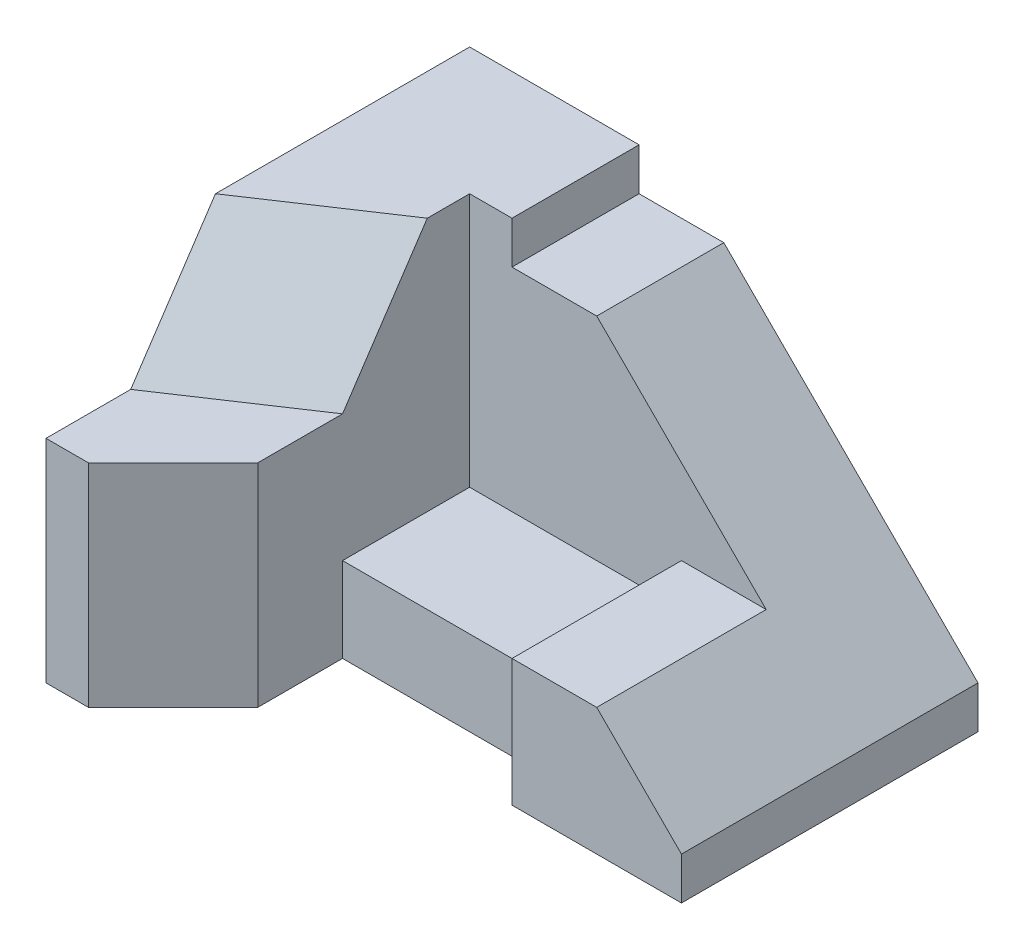
ISO-10303-21;
HEADER;
FILE_DESCRIPTION(('STEP AP214'),'2;1');
FILE_NAME('part.step','',(''),(''),'','','');
FILE_SCHEMA(('AUTOMOTIVE_DESIGN { 1 0 10303 214 1 1 1 1 }'));
ENDSEC;
DATA;
#1=APPLICATION_CONTEXT('core data for automotive mechanical design processes');
#2=APPLICATION_PROTOCOL_DEFINITION('international standard','automotive_design',2000,#1);
#3=PRODUCT_CONTEXT('',#1,'mechanical');
#4=PRODUCT('Part','Part','',(#3));
#5=PRODUCT_RELATED_PRODUCT_CATEGORY('part','',(#4));
#6=PRODUCT_DEFINITION_FORMATION('','',#4);
#7=PRODUCT_DEFINITION_CONTEXT('part definition',#1,'design');
#8=PRODUCT_DEFINITION('design','',#6,#7);
#9=PRODUCT_DEFINITION_SHAPE('','',#8);
#10=(LENGTH_UNIT() NAMED_UNIT(*) SI_UNIT(.MILLI.,.METRE.));
#11=(NAMED_UNIT(*) PLANE_ANGLE_UNIT() SI_UNIT($,.RADIAN.));
#12=(NAMED_UNIT(*) SI_UNIT($,.STERADIAN.) SOLID_ANGLE_UNIT());
#13=UNCERTAINTY_MEASURE_WITH_UNIT(LENGTH_MEASURE(1.E-05),#10,'distance_accuracy_value','');
#14=(GEOMETRIC_REPRESENTATION_CONTEXT(3) GLOBAL_UNCERTAINTY_ASSIGNED_CONTEXT((#13)) GLOBAL_UNIT_ASSIGNED_CONTEXT((#10,
#11,#12)) REPRESENTATION_CONTEXT('',''));
#15=CARTESIAN_POINT('',(0.,0.,0.));
#16=DIRECTION('',(0.,0.,1.));
#17=DIRECTION('',(1.,0.,0.));
#18=AXIS2_PLACEMENT_3D('',#15,#16,#17);
#19=CARTESIAN_POINT('',(40.,80.,-30.));
#20=DIRECTION('',(0.,0.,-1.));
#21=DIRECTION('',(-1.,0.,0.));
#22=AXIS2_PLACEMENT_3D('',#19,#20,#21);
#23=PLANE('',#22);
#24=DIRECTION('',(1.,0.,0.));
#25=VECTOR('',#24,1.);
#26=CARTESIAN_POINT('',(0.,20.,-30.));
#27=LINE('',#26,#25);
#28=CARTESIAN_POINT('',(30.,20.,-30.));
#29=VERTEX_POINT('',#28);
#30=CARTESIAN_POINT('',(80.,20.,-30.));
#31=VERTEX_POINT('',#30);
#32=EDGE_CURVE('E142',#29,#31,#27,.T.);
#33=ORIENTED_EDGE('',*,*,#32,.T.);
#34=DIRECTION('',(0.,1.,0.));
#35=VECTOR('',#34,1.);
#36=CARTESIAN_POINT('',(80.,30.,-30.));
#37=LINE('',#36,#35);
#38=CARTESIAN_POINT('',(80.,30.,-30.));
#39=VERTEX_POINT('',#38);
#40=EDGE_CURVE('E293',#31,#39,#37,.T.);
#41=ORIENTED_EDGE('',*,*,#40,.T.);
#42=DIRECTION('',(1.,0.,0.));
#43=VECTOR('',#42,1.);
#44=CARTESIAN_POINT('',(100.,30.,-30.));
#45=LINE('',#44,#43);
#46=CARTESIAN_POINT('',(100.,30.,-30.));
#47=VERTEX_POINT('',#46);
#48=EDGE_CURVE('E299',#39,#47,#45,.T.);
#49=ORIENTED_EDGE('',*,*,#48,.T.);
#50=DIRECTION('',(-0.707106781186548,0.707106781186548,0.));
#51=VECTOR('',#50,1.);
#52=CARTESIAN_POINT('',(60.,70.,-30.));
#53=LINE('',#52,#51);
#54=CARTESIAN_POINT('',(60.,70.,-30.));
#55=VERTEX_POINT('',#54);
#56=EDGE_CURVE('E297',#47,#55,#53,.T.);
#57=ORIENTED_EDGE('',*,*,#56,.T.);
#58=DIRECTION('',(1.,0.,0.));
#59=VECTOR('',#58,1.);
#60=CARTESIAN_POINT('',(40.,70.,-30.));
#61=LINE('',#60,#59);
#62=CARTESIAN_POINT('',(40.,70.,-30.));
#63=VERTEX_POINT('',#62);
#64=EDGE_CURVE('E116',#63,#55,#61,.T.);
#65=ORIENTED_EDGE('',*,*,#64,.F.);
#66=DIRECTION('',(0.,-1.,0.));
#67=VECTOR('',#66,1.);
#68=CARTESIAN_POINT('',(40.,80.,-30.));
#69=LINE('',#68,#67);
#70=CARTESIAN_POINT('',(40.,80.,-30.));
#71=VERTEX_POINT('',#70);
#72=EDGE_CURVE('E44',#71,#63,#69,.T.);
#73=ORIENTED_EDGE('',*,*,#72,.F.);
#74=DIRECTION('',(1.,0.,0.));
#75=VECTOR('',#74,1.);
#76=CARTESIAN_POINT('',(40.,80.,-30.));
#77=LINE('',#76,#75);
#78=CARTESIAN_POINT('',(30.,80.,-30.));
#79=VERTEX_POINT('',#78);
#80=EDGE_CURVE('E100',#79,#71,#77,.T.);
#81=ORIENTED_EDGE('',*,*,#80,.F.);
#82=DIRECTION('',(0.,-1.,0.));
#83=VECTOR('',#82,1.);
#84=CARTESIAN_POINT('',(30.,80.,-30.));
#85=LINE('',#84,#83);
#86=EDGE_CURVE('E11',#79,#29,#85,.T.);
#87=ORIENTED_EDGE('',*,*,#86,.T.);
#88=EDGE_LOOP('',(#33,#41,#49,#57,#65,#73,#81,#87));
#89=FACE_BOUND('',#88,.T.);
#90=ADVANCED_FACE('F35',(#89),#23,.F.);
#91=CARTESIAN_POINT('',(0.,80.,-60.));
#92=DIRECTION('',(0.,0.,1.));
#93=DIRECTION('',(1.,0.,0.));
#94=AXIS2_PLACEMENT_3D('',#91,#92,#93);
#95=PLANE('',#94);
#96=DIRECTION('',(0.,1.,0.));
#97=VECTOR('',#96,1.);
#98=CARTESIAN_POINT('',(120.,10.,-60.));
#99=LINE('',#98,#97);
#100=CARTESIAN_POINT('',(120.,0.,-60.));
#101=VERTEX_POINT('',#100);
#102=CARTESIAN_POINT('',(120.,10.,-60.));
#103=VERTEX_POINT('',#102);
#104=EDGE_CURVE('E263',#101,#103,#99,.T.);
#105=ORIENTED_EDGE('',*,*,#104,.F.);
#106=DIRECTION('',(-1.,0.,0.));
#107=VECTOR('',#106,1.);
#108=CARTESIAN_POINT('',(0.,0.,-60.));
#109=LINE('',#108,#107);
#110=CARTESIAN_POINT('',(0.,0.,-60.));
#111=VERTEX_POINT('',#110);
#112=EDGE_CURVE('E73',#101,#111,#109,.T.);
#113=ORIENTED_EDGE('',*,*,#112,.T.);
#114=DIRECTION('',(0.,-1.,0.));
#115=VECTOR('',#114,1.);
#116=CARTESIAN_POINT('',(0.,80.,-60.));
#117=LINE('',#116,#115);
#118=CARTESIAN_POINT('',(0.,80.,-60.));
#119=VERTEX_POINT('',#118);
#120=EDGE_CURVE('E126',#119,#111,#117,.T.);
#121=ORIENTED_EDGE('',*,*,#120,.F.);
#122=DIRECTION('',(-1.,0.,0.));
#123=VECTOR('',#122,1.);
#124=CARTESIAN_POINT('',(0.,80.,-60.));
#125=LINE('',#124,#123);
#126=CARTESIAN_POINT('',(40.,80.,-60.));
#127=VERTEX_POINT('',#126);
#128=EDGE_CURVE('E61',#127,#119,#125,.T.);
#129=ORIENTED_EDGE('',*,*,#128,.F.);
#130=DIRECTION('',(0.,-1.,0.));
#131=VECTOR('',#130,1.);
#132=CARTESIAN_POINT('',(40.,80.,-60.));
#133=LINE('',#132,#131);
#134=CARTESIAN_POINT('',(40.,70.,-60.));
#135=VERTEX_POINT('',#134);
#136=EDGE_CURVE('E117',#127,#135,#133,.T.);
#137=ORIENTED_EDGE('',*,*,#136,.T.);
#138=DIRECTION('',(-1.,0.,0.));
#139=VECTOR('',#138,1.);
#140=CARTESIAN_POINT('',(40.,70.,-60.));
#141=LINE('',#140,#139);
#142=CARTESIAN_POINT('',(60.,70.,-60.));
#143=VERTEX_POINT('',#142);
#144=EDGE_CURVE('E143',#143,#135,#141,.T.);
#145=ORIENTED_EDGE('',*,*,#144,.F.);
#146=DIRECTION('',(-0.707106781186548,0.707106781186548,0.));
#147=VECTOR('',#146,1.);
#148=CARTESIAN_POINT('',(60.,70.,-60.));
#149=LINE('',#148,#147);
#150=EDGE_CURVE('E294',#103,#143,#149,.T.);
#151=ORIENTED_EDGE('',*,*,#150,.F.);
#152=EDGE_LOOP('',(#105,#113,#121,#129,#137,#145,#151));
#153=FACE_BOUND('',#152,.T.);
#154=ADVANCED_FACE('F319',(#153),#95,.F.);
#155=CARTESIAN_POINT('',(40.,80.,-60.));
#156=DIRECTION('',(-1.,0.,0.));
#157=DIRECTION('',(0.,0.,1.));
#158=AXIS2_PLACEMENT_3D('',#155,#156,#157);
#159=PLANE('',#158);
#160=DIRECTION('',(0.,0.,1.));
#161=VECTOR('',#160,1.);
#162=CARTESIAN_POINT('',(40.,70.,-60.));
#163=LINE('',#162,#161);
#164=EDGE_CURVE('E52',#135,#63,#163,.T.);
#165=ORIENTED_EDGE('',*,*,#164,.F.);
#166=ORIENTED_EDGE('',*,*,#136,.F.);
#167=DIRECTION('',(0.,0.,-1.));
#168=VECTOR('',#167,1.);
#169=CARTESIAN_POINT('',(40.,80.,-60.));
#170=LINE('',#169,#168);
#171=EDGE_CURVE('E105',#71,#127,#170,.T.);
#172=ORIENTED_EDGE('',*,*,#171,.F.);
#173=ORIENTED_EDGE('',*,*,#72,.T.);
#174=EDGE_LOOP('',(#165,#166,#172,#173));
#175=FACE_BOUND('',#174,.T.);
#176=ADVANCED_FACE('F119',(#175),#159,.F.);
#177=CARTESIAN_POINT('',(0.,80.,0.));
#178=DIRECTION('',(0.,-1.,0.));
#179=DIRECTION('',(0.,0.,-1.));
#180=AXIS2_PLACEMENT_3D('',#177,#178,#179);
#181=PLANE('',#180);
#182=DIRECTION('',(0.832050294337844,0.,-0.554700196225229));
#183=VECTOR('',#182,1.);
#184=CARTESIAN_POINT('',(30.,80.,-20.));
#185=LINE('',#184,#183);
#186=CARTESIAN_POINT('',(0.,80.,0.));
#187=VERTEX_POINT('',#186);
#188=CARTESIAN_POINT('',(30.,80.,-20.));
#189=VERTEX_POINT('',#188);
#190=EDGE_CURVE('E130',#187,#189,#185,.T.);
#191=ORIENTED_EDGE('',*,*,#190,.T.);
#192=DIRECTION('',(0.,0.,-1.));
#193=VECTOR('',#192,1.);
#194=CARTESIAN_POINT('',(30.,80.,-30.));
#195=LINE('',#194,#193);
#196=EDGE_CURVE('E107',#189,#79,#195,.T.);
#197=ORIENTED_EDGE('',*,*,#196,.T.);
#198=ORIENTED_EDGE('',*,*,#80,.T.);
#199=ORIENTED_EDGE('',*,*,#171,.T.);
#200=ORIENTED_EDGE('',*,*,#128,.T.);
#201=DIRECTION('',(0.,0.,1.));
#202=VECTOR('',#201,1.);
#203=CARTESIAN_POINT('',(0.,80.,0.));
#204=LINE('',#203,#202);
#205=EDGE_CURVE('E121',#119,#187,#204,.T.);
#206=ORIENTED_EDGE('',*,*,#205,.T.);
#207=EDGE_LOOP('',(#191,#197,#198,#199,#200,#206));
#208=FACE_BOUND('',#207,.T.);
#209=ADVANCED_FACE('F103',(#208),#181,.F.);
#210=CARTESIAN_POINT('',(30.,80.,-30.));
#211=DIRECTION('',(-1.,0.,0.));
#212=DIRECTION('',(0.,0.,1.));
#213=AXIS2_PLACEMENT_3D('',#210,#211,#212);
#214=PLANE('',#213);
#215=ORIENTED_EDGE('',*,*,#196,.F.);
#216=DIRECTION('',(0.,0.832050294337843,-0.554700196225229));
#217=VECTOR('',#216,1.);
#218=CARTESIAN_POINT('',(30.,50.,0.));
#219=LINE('',#218,#217);
#220=CARTESIAN_POINT('',(30.,50.,0.));
#221=VERTEX_POINT('',#220);
#222=EDGE_CURVE('E150',#221,#189,#219,.T.);
#223=ORIENTED_EDGE('',*,*,#222,.F.);
#224=DIRECTION('',(0.,0.,-1.));
#225=VECTOR('',#224,1.);
#226=CARTESIAN_POINT('',(30.,50.,0.));
#227=LINE('',#226,#225);
#228=CARTESIAN_POINT('',(30.,50.,20.));
#229=VERTEX_POINT('',#228);
#230=EDGE_CURVE('E233',#229,#221,#227,.T.);
#231=ORIENTED_EDGE('',*,*,#230,.F.);
#232=DIRECTION('',(0.,-1.,0.));
#233=VECTOR('',#232,1.);
#234=CARTESIAN_POINT('',(30.,50.,20.));
#235=LINE('',#234,#233);
#236=CARTESIAN_POINT('',(30.,0.,20.));
#237=VERTEX_POINT('',#236);
#238=EDGE_CURVE('E241',#229,#237,#235,.T.);
#239=ORIENTED_EDGE('',*,*,#238,.T.);
#240=DIRECTION('',(0.,0.,-1.));
#241=VECTOR('',#240,1.);
#242=CARTESIAN_POINT('',(30.,0.,0.));
#243=LINE('',#242,#241);
#244=CARTESIAN_POINT('',(30.,0.,0.));
#245=VERTEX_POINT('',#244);
#246=EDGE_CURVE('E244',#237,#245,#243,.T.);
#247=ORIENTED_EDGE('',*,*,#246,.T.);
#248=DIRECTION('',(0.,1.,0.));
#249=VECTOR('',#248,1.);
#250=CARTESIAN_POINT('',(30.,20.,0.));
#251=LINE('',#250,#249);
#252=CARTESIAN_POINT('',(30.,20.,0.));
#253=VERTEX_POINT('',#252);
#254=EDGE_CURVE('E256',#245,#253,#251,.T.);
#255=ORIENTED_EDGE('',*,*,#254,.T.);
#256=DIRECTION('',(0.,0.,-1.));
#257=VECTOR('',#256,1.);
#258=CARTESIAN_POINT('',(30.,20.,0.));
#259=LINE('',#258,#257);
#260=EDGE_CURVE('E181',#253,#29,#259,.T.);
#261=ORIENTED_EDGE('',*,*,#260,.T.);
#262=ORIENTED_EDGE('',*,*,#86,.F.);
#263=EDGE_LOOP('',(#215,#223,#231,#239,#247,#255,#261,#262));
#264=FACE_BOUND('',#263,.T.);
#265=ADVANCED_FACE('F37',(#264),#214,.F.);
#266=CARTESIAN_POINT('',(0.,80.,0.));
#267=DIRECTION('',(1.,0.,0.));
#268=DIRECTION('',(0.,0.,-1.));
#269=AXIS2_PLACEMENT_3D('',#266,#267,#268);
#270=PLANE('',#269);
#271=DIRECTION('',(0.,0.,1.));
#272=VECTOR('',#271,1.);
#273=CARTESIAN_POINT('',(0.,50.,0.));
#274=LINE('',#273,#272);
#275=CARTESIAN_POINT('',(0.,50.,20.));
#276=VERTEX_POINT('',#275);
#277=CARTESIAN_POINT('',(0.,50.,40.));
#278=VERTEX_POINT('',#277);
#279=EDGE_CURVE('E163',#276,#278,#274,.T.);
#280=ORIENTED_EDGE('',*,*,#279,.F.);
#281=DIRECTION('',(0.,-0.832050294337844,0.554700196225229));
#282=VECTOR('',#281,1.);
#283=CARTESIAN_POINT('',(0.,24.6153846153846,36.9230769230769));
#284=LINE('',#283,#282);
#285=EDGE_CURVE('E160',#187,#276,#284,.T.);
#286=ORIENTED_EDGE('',*,*,#285,.F.);
#287=ORIENTED_EDGE('',*,*,#205,.F.);
#288=ORIENTED_EDGE('',*,*,#120,.T.);
#289=DIRECTION('',(0.,0.,1.));
#290=VECTOR('',#289,1.);
#291=CARTESIAN_POINT('',(0.,0.,0.));
#292=LINE('',#291,#290);
#293=CARTESIAN_POINT('',(0.,0.,40.));
#294=VERTEX_POINT('',#293);
#295=EDGE_CURVE('E128',#111,#294,#292,.T.);
#296=ORIENTED_EDGE('',*,*,#295,.T.);
#297=DIRECTION('',(0.,-1.,0.));
#298=VECTOR('',#297,1.);
#299=CARTESIAN_POINT('',(0.,0.,40.));
#300=LINE('',#299,#298);
#301=EDGE_CURVE('E155',#278,#294,#300,.T.);
#302=ORIENTED_EDGE('',*,*,#301,.F.);
#303=EDGE_LOOP('',(#280,#286,#287,#288,#296,#302));
#304=FACE_BOUND('',#303,.T.);
#305=ADVANCED_FACE('F229',(#304),#270,.F.);
#306=CARTESIAN_POINT('',(0.,0.,0.));
#307=DIRECTION('',(0.,-1.,0.));
#308=DIRECTION('',(0.,0.,-1.));
#309=AXIS2_PLACEMENT_3D('',#306,#307,#308);
#310=PLANE('',#309);
#311=DIRECTION('',(-0.707106781186548,0.,0.707106781186548));
#312=VECTOR('',#311,1.);
#313=CARTESIAN_POINT('',(25.,0.,25.));
#314=LINE('',#313,#312);
#315=CARTESIAN_POINT('',(10.,0.,40.));
#316=VERTEX_POINT('',#315);
#317=EDGE_CURVE('E239',#237,#316,#314,.T.);
#318=ORIENTED_EDGE('',*,*,#317,.T.);
#319=DIRECTION('',(-1.,0.,0.));
#320=VECTOR('',#319,1.);
#321=CARTESIAN_POINT('',(10.,0.,40.));
#322=LINE('',#321,#320);
#323=EDGE_CURVE('E159',#316,#294,#322,.T.);
#324=ORIENTED_EDGE('',*,*,#323,.T.);
#325=ORIENTED_EDGE('',*,*,#295,.F.);
#326=ORIENTED_EDGE('',*,*,#112,.F.);
#327=DIRECTION('',(0.,0.,-1.));
#328=VECTOR('',#327,1.);
#329=CARTESIAN_POINT('',(120.,0.,10.));
#330=LINE('',#329,#328);
#331=CARTESIAN_POINT('',(120.,0.,10.));
#332=VERTEX_POINT('',#331);
#333=EDGE_CURVE('E284',#332,#101,#330,.T.);
#334=ORIENTED_EDGE('',*,*,#333,.F.);
#335=DIRECTION('',(1.,0.,0.));
#336=VECTOR('',#335,1.);
#337=CARTESIAN_POINT('',(120.,0.,10.));
#338=LINE('',#337,#336);
#339=CARTESIAN_POINT('',(80.,0.,10.));
#340=VERTEX_POINT('',#339);
#341=EDGE_CURVE('E272',#340,#332,#338,.T.);
#342=ORIENTED_EDGE('',*,*,#341,.F.);
#343=DIRECTION('',(0.,0.,-1.));
#344=VECTOR('',#343,1.);
#345=CARTESIAN_POINT('',(80.,0.,10.));
#346=LINE('',#345,#344);
#347=CARTESIAN_POINT('',(80.,0.,0.));
#348=VERTEX_POINT('',#347);
#349=EDGE_CURVE('E287',#340,#348,#346,.T.);
#350=ORIENTED_EDGE('',*,*,#349,.T.);
#351=DIRECTION('',(-1.,0.,0.));
#352=VECTOR('',#351,1.);
#353=CARTESIAN_POINT('',(80.,0.,0.));
#354=LINE('',#353,#352);
#355=EDGE_CURVE('E253',#348,#245,#354,.T.);
#356=ORIENTED_EDGE('',*,*,#355,.T.);
#357=ORIENTED_EDGE('',*,*,#246,.F.);
#358=EDGE_LOOP('',(#318,#324,#325,#326,#334,#342,#350,#356,#357));
#359=FACE_BOUND('',#358,.T.);
#360=ADVANCED_FACE('F343',(#359),#310,.T.);
#361=CARTESIAN_POINT('',(10.,50.,0.));
#362=DIRECTION('',(0.,-1.,0.));
#363=DIRECTION('',(0.,0.,-1.));
#364=AXIS2_PLACEMENT_3D('',#361,#362,#363);
#365=PLANE('',#364);
#366=ORIENTED_EDGE('',*,*,#279,.T.);
#367=DIRECTION('',(-1.,0.,0.));
#368=VECTOR('',#367,1.);
#369=CARTESIAN_POINT('',(10.,50.,40.));
#370=LINE('',#369,#368);
#371=CARTESIAN_POINT('',(10.,50.,40.));
#372=VERTEX_POINT('',#371);
#373=EDGE_CURVE('E85',#372,#278,#370,.T.);
#374=ORIENTED_EDGE('',*,*,#373,.F.);
#375=DIRECTION('',(-0.707106781186548,0.,0.707106781186548));
#376=VECTOR('',#375,1.);
#377=CARTESIAN_POINT('',(25.,50.,25.));
#378=LINE('',#377,#376);
#379=EDGE_CURVE('E237',#229,#372,#378,.T.);
#380=ORIENTED_EDGE('',*,*,#379,.F.);
#381=ORIENTED_EDGE('',*,*,#230,.T.);
#382=DIRECTION('',(0.832050294337844,0.,-0.554700196225229));
#383=VECTOR('',#382,1.);
#384=CARTESIAN_POINT('',(0.,50.,20.));
#385=LINE('',#384,#383);
#386=EDGE_CURVE('E152',#276,#221,#385,.T.);
#387=ORIENTED_EDGE('',*,*,#386,.F.);
#388=EDGE_LOOP('',(#366,#374,#380,#381,#387));
#389=FACE_BOUND('',#388,.T.);
#390=ADVANCED_FACE('F234',(#389),#365,.F.);
#391=CARTESIAN_POINT('',(10.,0.,40.));
#392=DIRECTION('',(0.,0.,-1.));
#393=DIRECTION('',(0.,1.,0.));
#394=AXIS2_PLACEMENT_3D('',#391,#392,#393);
#395=PLANE('',#394);
#396=ORIENTED_EDGE('',*,*,#301,.T.);
#397=ORIENTED_EDGE('',*,*,#323,.F.);
#398=DIRECTION('',(0.,-1.,0.));
#399=VECTOR('',#398,1.);
#400=CARTESIAN_POINT('',(10.,0.,40.));
#401=LINE('',#400,#399);
#402=EDGE_CURVE('E156',#372,#316,#401,.T.);
#403=ORIENTED_EDGE('',*,*,#402,.F.);
#404=ORIENTED_EDGE('',*,*,#373,.T.);
#405=EDGE_LOOP('',(#396,#397,#403,#404));
#406=FACE_BOUND('',#405,.T.);
#407=ADVANCED_FACE('F331',(#406),#395,.F.);
#408=CARTESIAN_POINT('',(18.8235294117647,18.8235294117647,28.2352941176471));
#409=DIRECTION('',(0.485071250072666,0.485071250072666,0.727606875108999));
#410=DIRECTION('',(0.832050294337844,0.,-0.554700196225229));
#411=AXIS2_PLACEMENT_3D('',#408,#409,#410);
#412=PLANE('',#411);
#413=ORIENTED_EDGE('',*,*,#386,.T.);
#414=ORIENTED_EDGE('',*,*,#222,.T.);
#415=ORIENTED_EDGE('',*,*,#190,.F.);
#416=ORIENTED_EDGE('',*,*,#285,.T.);
#417=EDGE_LOOP('',(#413,#414,#415,#416));
#418=FACE_BOUND('',#417,.T.);
#419=ADVANCED_FACE('F231',(#418),#412,.T.);
#420=CARTESIAN_POINT('',(0.,70.,0.));
#421=DIRECTION('',(0.,1.,0.));
#422=DIRECTION('',(0.,0.,1.));
#423=AXIS2_PLACEMENT_3D('',#420,#421,#422);
#424=PLANE('',#423);
#425=ORIENTED_EDGE('',*,*,#164,.T.);
#426=ORIENTED_EDGE('',*,*,#64,.T.);
#427=DIRECTION('',(0.,0.,-1.));
#428=VECTOR('',#427,1.);
#429=CARTESIAN_POINT('',(60.,70.,-60.));
#430=LINE('',#429,#428);
#431=EDGE_CURVE('E138',#55,#143,#430,.T.);
#432=ORIENTED_EDGE('',*,*,#431,.T.);
#433=ORIENTED_EDGE('',*,*,#144,.T.);
#434=EDGE_LOOP('',(#425,#426,#432,#433));
#435=FACE_BOUND('',#434,.T.);
#436=ADVANCED_FACE('F322',(#435),#424,.T.);
#437=CARTESIAN_POINT('',(60.,70.,-60.));
#438=DIRECTION('',(0.707106781186547,0.707106781186547,0.));
#439=DIRECTION('',(-0.707106781186548,0.707106781186548,0.));
#440=AXIS2_PLACEMENT_3D('',#437,#438,#439);
#441=PLANE('',#440);
#442=ORIENTED_EDGE('',*,*,#56,.F.);
#443=DIRECTION('',(0.,0.,-1.));
#444=VECTOR('',#443,1.);
#445=CARTESIAN_POINT('',(100.,30.,10.));
#446=LINE('',#445,#444);
#447=CARTESIAN_POINT('',(100.,30.,10.));
#448=VERTEX_POINT('',#447);
#449=EDGE_CURVE('E278',#448,#47,#446,.T.);
#450=ORIENTED_EDGE('',*,*,#449,.F.);
#451=DIRECTION('',(-0.707106781186547,0.707106781186548,0.));
#452=VECTOR('',#451,1.);
#453=CARTESIAN_POINT('',(100.,30.,10.));
#454=LINE('',#453,#452);
#455=CARTESIAN_POINT('',(120.,10.,10.));
#456=VERTEX_POINT('',#455);
#457=EDGE_CURVE('E276',#456,#448,#454,.T.);
#458=ORIENTED_EDGE('',*,*,#457,.F.);
#459=DIRECTION('',(0.,0.,-1.));
#460=VECTOR('',#459,1.);
#461=CARTESIAN_POINT('',(120.,10.,10.));
#462=LINE('',#461,#460);
#463=EDGE_CURVE('E281',#456,#103,#462,.T.);
#464=ORIENTED_EDGE('',*,*,#463,.T.);
#465=ORIENTED_EDGE('',*,*,#150,.T.);
#466=ORIENTED_EDGE('',*,*,#431,.F.);
#467=EDGE_LOOP('',(#442,#450,#458,#464,#465,#466));
#468=FACE_BOUND('',#467,.T.);
#469=ADVANCED_FACE('F305',(#468),#441,.T.);
#470=CARTESIAN_POINT('',(80.,0.,10.));
#471=DIRECTION('',(1.,0.,0.));
#472=DIRECTION('',(0.,0.,-1.));
#473=AXIS2_PLACEMENT_3D('',#470,#471,#472);
#474=PLANE('',#473);
#475=ORIENTED_EDGE('',*,*,#40,.F.);
#476=DIRECTION('',(0.,0.,-1.));
#477=VECTOR('',#476,1.);
#478=CARTESIAN_POINT('',(80.,20.,0.));
#479=LINE('',#478,#477);
#480=CARTESIAN_POINT('',(80.,20.,0.));
#481=VERTEX_POINT('',#480);
#482=EDGE_CURVE('E261',#481,#31,#479,.T.);
#483=ORIENTED_EDGE('',*,*,#482,.F.);
#484=DIRECTION('',(0.,-1.,0.));
#485=VECTOR('',#484,1.);
#486=CARTESIAN_POINT('',(80.,20.,0.));
#487=LINE('',#486,#485);
#488=EDGE_CURVE('E250',#481,#348,#487,.T.);
#489=ORIENTED_EDGE('',*,*,#488,.T.);
#490=ORIENTED_EDGE('',*,*,#349,.F.);
#491=DIRECTION('',(0.,-1.,0.));
#492=VECTOR('',#491,1.);
#493=CARTESIAN_POINT('',(80.,0.,10.));
#494=LINE('',#493,#492);
#495=CARTESIAN_POINT('',(80.,30.,10.));
#496=VERTEX_POINT('',#495);
#497=EDGE_CURVE('E270',#496,#340,#494,.T.);
#498=ORIENTED_EDGE('',*,*,#497,.F.);
#499=DIRECTION('',(0.,0.,-1.));
#500=VECTOR('',#499,1.);
#501=CARTESIAN_POINT('',(80.,30.,10.));
#502=LINE('',#501,#500);
#503=EDGE_CURVE('E290',#496,#39,#502,.T.);
#504=ORIENTED_EDGE('',*,*,#503,.T.);
#505=EDGE_LOOP('',(#475,#483,#489,#490,#498,#504));
#506=FACE_BOUND('',#505,.T.);
#507=ADVANCED_FACE('F329',(#506),#474,.F.);
#508=CARTESIAN_POINT('',(80.,30.,10.));
#509=DIRECTION('',(0.,-1.,0.));
#510=DIRECTION('',(1.,0.,0.));
#511=AXIS2_PLACEMENT_3D('',#508,#509,#510);
#512=PLANE('',#511);
#513=ORIENTED_EDGE('',*,*,#449,.T.);
#514=ORIENTED_EDGE('',*,*,#48,.F.);
#515=ORIENTED_EDGE('',*,*,#503,.F.);
#516=DIRECTION('',(-1.,0.,0.));
#517=VECTOR('',#516,1.);
#518=CARTESIAN_POINT('',(80.,30.,10.));
#519=LINE('',#518,#517);
#520=EDGE_CURVE('E267',#448,#496,#519,.T.);
#521=ORIENTED_EDGE('',*,*,#520,.F.);
#522=EDGE_LOOP('',(#513,#514,#515,#521));
#523=FACE_BOUND('',#522,.T.);
#524=ADVANCED_FACE('F309',(#523),#512,.F.);
#525=CARTESIAN_POINT('',(120.,10.,10.));
#526=DIRECTION('',(-1.,0.,0.));
#527=DIRECTION('',(0.,0.,1.));
#528=AXIS2_PLACEMENT_3D('',#525,#526,#527);
#529=PLANE('',#528);
#530=ORIENTED_EDGE('',*,*,#333,.T.);
#531=ORIENTED_EDGE('',*,*,#104,.T.);
#532=ORIENTED_EDGE('',*,*,#463,.F.);
#533=DIRECTION('',(0.,1.,0.));
#534=VECTOR('',#533,1.);
#535=CARTESIAN_POINT('',(120.,10.,10.));
#536=LINE('',#535,#534);
#537=EDGE_CURVE('E274',#332,#456,#536,.T.);
#538=ORIENTED_EDGE('',*,*,#537,.F.);
#539=EDGE_LOOP('',(#530,#531,#532,#538));
#540=FACE_BOUND('',#539,.T.);
#541=ADVANCED_FACE('F317',(#540),#529,.F.);
#542=CARTESIAN_POINT('',(0.,0.,10.));
#543=DIRECTION('',(0.,0.,-1.));
#544=DIRECTION('',(-1.,0.,0.));
#545=AXIS2_PLACEMENT_3D('',#542,#543,#544);
#546=PLANE('',#545);
#547=ORIENTED_EDGE('',*,*,#520,.T.);
#548=ORIENTED_EDGE('',*,*,#497,.T.);
#549=ORIENTED_EDGE('',*,*,#341,.T.);
#550=ORIENTED_EDGE('',*,*,#537,.T.);
#551=ORIENTED_EDGE('',*,*,#457,.T.);
#552=EDGE_LOOP('',(#547,#548,#549,#550,#551));
#553=FACE_BOUND('',#552,.T.);
#554=ADVANCED_FACE('F312',(#553),#546,.F.);
#555=CARTESIAN_POINT('',(80.,20.,0.));
#556=DIRECTION('',(0.,1.,0.));
#557=DIRECTION('',(0.,0.,1.));
#558=AXIS2_PLACEMENT_3D('',#555,#556,#557);
#559=PLANE('',#558);
#560=ORIENTED_EDGE('',*,*,#32,.F.);
#561=ORIENTED_EDGE('',*,*,#260,.F.);
#562=DIRECTION('',(1.,0.,0.));
#563=VECTOR('',#562,1.);
#564=CARTESIAN_POINT('',(80.,20.,0.));
#565=LINE('',#564,#563);
#566=EDGE_CURVE('E258',#253,#481,#565,.T.);
#567=ORIENTED_EDGE('',*,*,#566,.T.);
#568=ORIENTED_EDGE('',*,*,#482,.T.);
#569=EDGE_LOOP('',(#560,#561,#567,#568));
#570=FACE_BOUND('',#569,.T.);
#571=ADVANCED_FACE('F447',(#570),#559,.T.);
#572=CARTESIAN_POINT('',(0.,0.,0.));
#573=DIRECTION('',(0.,0.,-1.));
#574=DIRECTION('',(-1.,0.,0.));
#575=AXIS2_PLACEMENT_3D('',#572,#573,#574);
#576=PLANE('',#575);
#577=ORIENTED_EDGE('',*,*,#488,.F.);
#578=ORIENTED_EDGE('',*,*,#566,.F.);
#579=ORIENTED_EDGE('',*,*,#254,.F.);
#580=ORIENTED_EDGE('',*,*,#355,.F.);
#581=EDGE_LOOP('',(#577,#578,#579,#580));
#582=FACE_BOUND('',#581,.T.);
#583=ADVANCED_FACE('F502',(#582),#576,.F.);
#584=CARTESIAN_POINT('',(25.,50.,25.));
#585=DIRECTION('',(0.707106781186548,0.,0.707106781186548));
#586=DIRECTION('',(0.707106781186548,0.,-0.707106781186548));
#587=AXIS2_PLACEMENT_3D('',#584,#585,#586);
#588=PLANE('',#587);
#589=ORIENTED_EDGE('',*,*,#317,.F.);
#590=ORIENTED_EDGE('',*,*,#238,.F.);
#591=ORIENTED_EDGE('',*,*,#379,.T.);
#592=ORIENTED_EDGE('',*,*,#402,.T.);
#593=EDGE_LOOP('',(#589,#590,#591,#592));
#594=FACE_BOUND('',#593,.T.);
#595=ADVANCED_FACE('F497',(#594),#588,.T.);
#596=CLOSED_SHELL('',(#90,#154,#176,#209,#265,#305,#360,#390,#407,#419,#436,#469,#507,#524,#541,
#554,#571,#583,#595));
#597=MANIFOLD_SOLID_BREP('B2',#596);
#598=ADVANCED_BREP_SHAPE_REPRESENTATION('',(#18,#597),#14);
#599=SHAPE_DEFINITION_REPRESENTATION(#9,#598);
ENDSEC;
END-ISO-10303-21;
